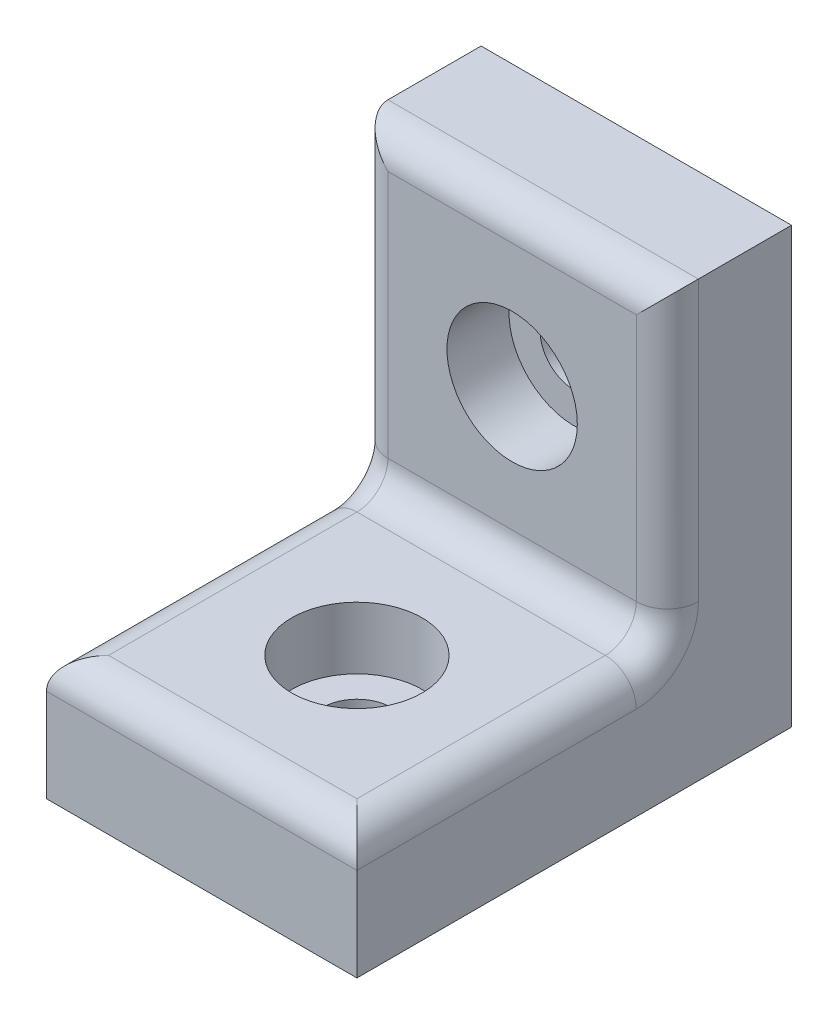
ISO-10303-21;
HEADER;
FILE_DESCRIPTION(('STEP AP214'),'2;1');
FILE_NAME('part.step','',(''),(''),'','','');
FILE_SCHEMA(('AUTOMOTIVE_DESIGN { 1 0 10303 214 1 1 1 1 }'));
ENDSEC;
DATA;
#1=APPLICATION_CONTEXT('core data for automotive mechanical design processes');
#2=APPLICATION_PROTOCOL_DEFINITION('international standard','automotive_design',2000,#1);
#3=PRODUCT_CONTEXT('',#1,'mechanical');
#4=PRODUCT('Part','Part','',(#3));
#5=PRODUCT_RELATED_PRODUCT_CATEGORY('part','',(#4));
#6=PRODUCT_DEFINITION_FORMATION('','',#4);
#7=PRODUCT_DEFINITION_CONTEXT('part definition',#1,'design');
#8=PRODUCT_DEFINITION('design','',#6,#7);
#9=PRODUCT_DEFINITION_SHAPE('','',#8);
#10=(LENGTH_UNIT() NAMED_UNIT(*) SI_UNIT(.MILLI.,.METRE.));
#11=(NAMED_UNIT(*) PLANE_ANGLE_UNIT() SI_UNIT($,.RADIAN.));
#12=(NAMED_UNIT(*) SI_UNIT($,.STERADIAN.) SOLID_ANGLE_UNIT());
#13=UNCERTAINTY_MEASURE_WITH_UNIT(LENGTH_MEASURE(1.E-05),#10,'distance_accuracy_value','');
#14=(GEOMETRIC_REPRESENTATION_CONTEXT(3) GLOBAL_UNCERTAINTY_ASSIGNED_CONTEXT((#13)) GLOBAL_UNIT_ASSIGNED_CONTEXT((#10,
#11,#12)) REPRESENTATION_CONTEXT('',''));
#15=CARTESIAN_POINT('',(0.,0.,0.));
#16=DIRECTION('',(0.,0.,1.));
#17=DIRECTION('',(1.,0.,0.));
#18=AXIS2_PLACEMENT_3D('',#15,#16,#17);
#19=CARTESIAN_POINT('',(0.,0.,9.));
#20=DIRECTION('',(0.,1.,0.));
#21=DIRECTION('',(0.,0.,1.));
#22=AXIS2_PLACEMENT_3D('',#19,#20,#21);
#23=CYLINDRICAL_SURFACE('',#22,1.1);
#24=CARTESIAN_POINT('',(0.,0.,9.));
#25=DIRECTION('',(0.,1.,0.));
#26=DIRECTION('',(0.,0.,1.));
#27=AXIS2_PLACEMENT_3D('',#24,#25,#26);
#28=CIRCLE('',#27,1.1);
#29=CARTESIAN_POINT('',(0.,0.,10.1));
#30=VERTEX_POINT('',#29);
#31=EDGE_CURVE('E201',#30,#30,#28,.T.);
#32=ORIENTED_EDGE('',*,*,#31,.F.);
#33=EDGE_LOOP('',(#32));
#34=FACE_BOUND('',#33,.T.);
#35=CARTESIAN_POINT('',(0.,2.,9.));
#36=DIRECTION('',(0.,1.,0.));
#37=DIRECTION('',(0.,0.,1.));
#38=AXIS2_PLACEMENT_3D('',#35,#36,#37);
#39=CIRCLE('',#38,1.1);
#40=CARTESIAN_POINT('',(0.,2.,10.1));
#41=VERTEX_POINT('',#40);
#42=EDGE_CURVE('E43',#41,#41,#39,.F.);
#43=ORIENTED_EDGE('',*,*,#42,.F.);
#44=EDGE_LOOP('',(#43));
#45=FACE_BOUND('',#44,.T.);
#46=ADVANCED_FACE('F39',(#34,#45),#23,.F.);
#47=CARTESIAN_POINT('',(0.,9.,0.));
#48=DIRECTION('',(0.,0.,1.));
#49=DIRECTION('',(1.,0.,0.));
#50=AXIS2_PLACEMENT_3D('',#47,#48,#49);
#51=CYLINDRICAL_SURFACE('',#50,1.1);
#52=CARTESIAN_POINT('',(0.,9.,0.));
#53=DIRECTION('',(0.,0.,1.));
#54=DIRECTION('',(1.,0.,0.));
#55=AXIS2_PLACEMENT_3D('',#52,#53,#54);
#56=CIRCLE('',#55,1.1);
#57=CARTESIAN_POINT('',(1.1,9.,0.));
#58=VERTEX_POINT('',#57);
#59=EDGE_CURVE('E136',#58,#58,#56,.T.);
#60=ORIENTED_EDGE('',*,*,#59,.F.);
#61=EDGE_LOOP('',(#60));
#62=FACE_BOUND('',#61,.T.);
#63=CARTESIAN_POINT('',(0.,9.,2.));
#64=DIRECTION('',(0.,0.,1.));
#65=DIRECTION('',(1.,0.,0.));
#66=AXIS2_PLACEMENT_3D('',#63,#64,#65);
#67=CIRCLE('',#66,1.1);
#68=CARTESIAN_POINT('',(1.1,9.,2.));
#69=VERTEX_POINT('',#68);
#70=EDGE_CURVE('E225',#69,#69,#67,.F.);
#71=ORIENTED_EDGE('',*,*,#70,.F.);
#72=EDGE_LOOP('',(#71));
#73=FACE_BOUND('',#72,.T.);
#74=ADVANCED_FACE('F248',(#62,#73),#51,.F.);
#75=CARTESIAN_POINT('',(-5.,14.,4.));
#76=DIRECTION('',(1.,0.,0.));
#77=DIRECTION('',(0.,1.,0.));
#78=AXIS2_PLACEMENT_3D('',#75,#76,#77);
#79=PLANE('',#78);
#80=CARTESIAN_POINT('',(-5.,5.,5.));
#81=DIRECTION('',(1.,0.,0.));
#82=DIRECTION('',(0.,1.,0.));
#83=AXIS2_PLACEMENT_3D('',#80,#81,#82);
#84=CIRCLE('',#83,2.);
#85=CARTESIAN_POINT('',(-5.,5.,3.));
#86=VERTEX_POINT('',#85);
#87=CARTESIAN_POINT('',(-5.,3.,5.));
#88=VERTEX_POINT('',#87);
#89=EDGE_CURVE('E185',#86,#88,#84,.F.);
#90=ORIENTED_EDGE('',*,*,#89,.F.);
#91=DIRECTION('',(0.,-1.,0.));
#92=VECTOR('',#91,1.);
#93=CARTESIAN_POINT('',(-5.,14.,3.));
#94=LINE('',#93,#92);
#95=CARTESIAN_POINT('',(-5.,14.,3.));
#96=VERTEX_POINT('',#95);
#97=EDGE_CURVE('E190',#86,#96,#94,.F.);
#98=ORIENTED_EDGE('',*,*,#97,.T.);
#99=DIRECTION('',(0.,0.,-1.));
#100=VECTOR('',#99,1.);
#101=CARTESIAN_POINT('',(-5.,14.,4.));
#102=LINE('',#101,#100);
#103=CARTESIAN_POINT('',(-5.,14.,0.));
#104=VERTEX_POINT('',#103);
#105=EDGE_CURVE('E164',#96,#104,#102,.T.);
#106=ORIENTED_EDGE('',*,*,#105,.T.);
#107=DIRECTION('',(0.,-1.,0.));
#108=VECTOR('',#107,1.);
#109=CARTESIAN_POINT('',(-5.,14.,0.));
#110=LINE('',#109,#108);
#111=CARTESIAN_POINT('',(-5.,0.,0.));
#112=VERTEX_POINT('',#111);
#113=EDGE_CURVE('E143',#104,#112,#110,.T.);
#114=ORIENTED_EDGE('',*,*,#113,.T.);
#115=DIRECTION('',(0.,0.,-1.));
#116=VECTOR('',#115,1.);
#117=CARTESIAN_POINT('',(-5.,0.,4.));
#118=LINE('',#117,#116);
#119=CARTESIAN_POINT('',(-5.,0.,14.));
#120=VERTEX_POINT('',#119);
#121=EDGE_CURVE('E140',#120,#112,#118,.T.);
#122=ORIENTED_EDGE('',*,*,#121,.F.);
#123=DIRECTION('',(0.,-1.,0.));
#124=VECTOR('',#123,1.);
#125=CARTESIAN_POINT('',(-5.,0.,14.));
#126=LINE('',#125,#124);
#127=CARTESIAN_POINT('',(-5.,3.,14.));
#128=VERTEX_POINT('',#127);
#129=EDGE_CURVE('E125',#128,#120,#126,.T.);
#130=ORIENTED_EDGE('',*,*,#129,.F.);
#131=DIRECTION('',(0.,0.,-1.));
#132=VECTOR('',#131,1.);
#133=CARTESIAN_POINT('',(-5.,3.,4.));
#134=LINE('',#133,#132);
#135=EDGE_CURVE('E188',#128,#88,#134,.T.);
#136=ORIENTED_EDGE('',*,*,#135,.T.);
#137=EDGE_LOOP('',(#90,#98,#106,#114,#122,#130,#136));
#138=FACE_BOUND('',#137,.T.);
#139=ADVANCED_FACE('F141',(#138),#79,.F.);
#140=CARTESIAN_POINT('',(-5.,0.,4.));
#141=DIRECTION('',(0.,1.,0.));
#142=DIRECTION('',(0.,0.,1.));
#143=AXIS2_PLACEMENT_3D('',#140,#141,#142);
#144=PLANE('',#143);
#145=ORIENTED_EDGE('',*,*,#31,.T.);
#146=EDGE_LOOP('',(#145));
#147=FACE_BOUND('',#146,.T.);
#148=DIRECTION('',(1.,0.,0.));
#149=VECTOR('',#148,1.);
#150=CARTESIAN_POINT('',(-5.,0.,0.));
#151=LINE('',#150,#149);
#152=CARTESIAN_POINT('',(5.,0.,0.));
#153=VERTEX_POINT('',#152);
#154=EDGE_CURVE('E156',#112,#153,#151,.T.);
#155=ORIENTED_EDGE('',*,*,#154,.T.);
#156=DIRECTION('',(0.,0.,-1.));
#157=VECTOR('',#156,1.);
#158=CARTESIAN_POINT('',(5.,0.,4.));
#159=LINE('',#158,#157);
#160=CARTESIAN_POINT('',(5.,0.,14.));
#161=VERTEX_POINT('',#160);
#162=EDGE_CURVE('E146',#161,#153,#159,.T.);
#163=ORIENTED_EDGE('',*,*,#162,.F.);
#164=DIRECTION('',(1.,0.,0.));
#165=VECTOR('',#164,1.);
#166=CARTESIAN_POINT('',(-5.,0.,14.));
#167=LINE('',#166,#165);
#168=EDGE_CURVE('E130',#120,#161,#167,.T.);
#169=ORIENTED_EDGE('',*,*,#168,.F.);
#170=ORIENTED_EDGE('',*,*,#121,.T.);
#171=EDGE_LOOP('',(#155,#163,#169,#170));
#172=FACE_BOUND('',#171,.T.);
#173=ADVANCED_FACE('F148',(#147,#172),#144,.F.);
#174=CARTESIAN_POINT('',(5.,14.,4.));
#175=DIRECTION('',(-1.,0.,0.));
#176=DIRECTION('',(0.,0.,1.));
#177=AXIS2_PLACEMENT_3D('',#174,#175,#176);
#178=PLANE('',#177);
#179=DIRECTION('',(0.,0.,-1.));
#180=VECTOR('',#179,1.);
#181=CARTESIAN_POINT('',(5.,14.,4.));
#182=LINE('',#181,#180);
#183=CARTESIAN_POINT('',(5.,14.,3.));
#184=VERTEX_POINT('',#183);
#185=CARTESIAN_POINT('',(5.,14.,0.));
#186=VERTEX_POINT('',#185);
#187=EDGE_CURVE('E166',#184,#186,#182,.T.);
#188=ORIENTED_EDGE('',*,*,#187,.F.);
#189=DIRECTION('',(0.,1.,0.));
#190=VECTOR('',#189,1.);
#191=CARTESIAN_POINT('',(5.,4.,3.));
#192=LINE('',#191,#190);
#193=CARTESIAN_POINT('',(5.,5.,3.));
#194=VERTEX_POINT('',#193);
#195=EDGE_CURVE('E182',#184,#194,#192,.F.);
#196=ORIENTED_EDGE('',*,*,#195,.T.);
#197=CARTESIAN_POINT('',(5.,5.,5.));
#198=DIRECTION('',(-1.,0.,0.));
#199=DIRECTION('',(0.,0.,1.));
#200=AXIS2_PLACEMENT_3D('',#197,#198,#199);
#201=CIRCLE('',#200,2.);
#202=CARTESIAN_POINT('',(5.,3.,5.));
#203=VERTEX_POINT('',#202);
#204=EDGE_CURVE('E179',#203,#194,#201,.F.);
#205=ORIENTED_EDGE('',*,*,#204,.F.);
#206=DIRECTION('',(0.,0.,-1.));
#207=VECTOR('',#206,1.);
#208=CARTESIAN_POINT('',(5.,3.,4.));
#209=LINE('',#208,#207);
#210=CARTESIAN_POINT('',(5.,3.,14.));
#211=VERTEX_POINT('',#210);
#212=EDGE_CURVE('E177',#203,#211,#209,.F.);
#213=ORIENTED_EDGE('',*,*,#212,.T.);
#214=DIRECTION('',(0.,1.,0.));
#215=VECTOR('',#214,1.);
#216=CARTESIAN_POINT('',(5.,0.,14.));
#217=LINE('',#216,#215);
#218=EDGE_CURVE('E150',#161,#211,#217,.T.);
#219=ORIENTED_EDGE('',*,*,#218,.F.);
#220=ORIENTED_EDGE('',*,*,#162,.T.);
#221=DIRECTION('',(0.,1.,0.));
#222=VECTOR('',#221,1.);
#223=CARTESIAN_POINT('',(5.,14.,0.));
#224=LINE('',#223,#222);
#225=EDGE_CURVE('E158',#153,#186,#224,.T.);
#226=ORIENTED_EDGE('',*,*,#225,.T.);
#227=EDGE_LOOP('',(#188,#196,#205,#213,#219,#220,#226));
#228=FACE_BOUND('',#227,.T.);
#229=ADVANCED_FACE('F276',(#228),#178,.F.);
#230=CARTESIAN_POINT('',(-5.,14.,4.));
#231=DIRECTION('',(0.,-1.,0.));
#232=DIRECTION('',(0.,0.,-1.));
#233=AXIS2_PLACEMENT_3D('',#230,#231,#232);
#234=PLANE('',#233);
#235=ORIENTED_EDGE('',*,*,#105,.F.);
#236=DIRECTION('',(-1.,0.,0.));
#237=VECTOR('',#236,1.);
#238=CARTESIAN_POINT('',(5.,14.,3.));
#239=LINE('',#238,#237);
#240=EDGE_CURVE('E12',#96,#184,#239,.F.);
#241=ORIENTED_EDGE('',*,*,#240,.T.);
#242=ORIENTED_EDGE('',*,*,#187,.T.);
#243=DIRECTION('',(-1.,0.,0.));
#244=VECTOR('',#243,1.);
#245=CARTESIAN_POINT('',(-5.,14.,0.));
#246=LINE('',#245,#244);
#247=EDGE_CURVE('E161',#186,#104,#246,.T.);
#248=ORIENTED_EDGE('',*,*,#247,.T.);
#249=EDGE_LOOP('',(#235,#241,#242,#248));
#250=FACE_BOUND('',#249,.T.);
#251=ADVANCED_FACE('F270',(#250),#234,.F.);
#252=CARTESIAN_POINT('',(0.,0.,4.));
#253=DIRECTION('',(0.,0.,1.));
#254=DIRECTION('',(1.,0.,0.));
#255=AXIS2_PLACEMENT_3D('',#252,#253,#254);
#256=PLANE('',#255);
#257=CARTESIAN_POINT('',(0.,9.,4.));
#258=DIRECTION('',(0.,0.,1.));
#259=DIRECTION('',(1.,0.,0.));
#260=AXIS2_PLACEMENT_3D('',#257,#258,#259);
#261=CIRCLE('',#260,2.1);
#262=CARTESIAN_POINT('',(2.1,9.,4.));
#263=VERTEX_POINT('',#262);
#264=EDGE_CURVE('E233',#263,#263,#261,.T.);
#265=ORIENTED_EDGE('',*,*,#264,.F.);
#266=EDGE_LOOP('',(#265));
#267=FACE_BOUND('',#266,.T.);
#268=DIRECTION('',(0.,1.,0.));
#269=VECTOR('',#268,1.);
#270=CARTESIAN_POINT('',(4.,14.,4.));
#271=LINE('',#270,#269);
#272=CARTESIAN_POINT('',(4.,5.,4.));
#273=VERTEX_POINT('',#272);
#274=CARTESIAN_POINT('',(4.,13.,4.));
#275=VERTEX_POINT('',#274);
#276=EDGE_CURVE('E172',#273,#275,#271,.T.);
#277=ORIENTED_EDGE('',*,*,#276,.T.);
#278=DIRECTION('',(-1.,0.,0.));
#279=VECTOR('',#278,1.);
#280=CARTESIAN_POINT('',(-5.,13.,4.));
#281=LINE('',#280,#279);
#282=CARTESIAN_POINT('',(-4.,13.,4.));
#283=VERTEX_POINT('',#282);
#284=EDGE_CURVE('E175',#275,#283,#281,.T.);
#285=ORIENTED_EDGE('',*,*,#284,.T.);
#286=DIRECTION('',(0.,-1.,0.));
#287=VECTOR('',#286,1.);
#288=CARTESIAN_POINT('',(-4.,4.,4.));
#289=LINE('',#288,#287);
#290=CARTESIAN_POINT('',(-4.,5.,4.));
#291=VERTEX_POINT('',#290);
#292=EDGE_CURVE('E170',#283,#291,#289,.T.);
#293=ORIENTED_EDGE('',*,*,#292,.T.);
#294=DIRECTION('',(-1.,0.,0.));
#295=VECTOR('',#294,1.);
#296=CARTESIAN_POINT('',(0.,5.,4.));
#297=LINE('',#296,#295);
#298=EDGE_CURVE('E145',#291,#273,#297,.F.);
#299=ORIENTED_EDGE('',*,*,#298,.T.);
#300=EDGE_LOOP('',(#277,#285,#293,#299));
#301=FACE_BOUND('',#300,.T.);
#302=ADVANCED_FACE('F267',(#267,#301),#256,.T.);
#303=CARTESIAN_POINT('',(0.,0.,0.));
#304=DIRECTION('',(0.,0.,1.));
#305=DIRECTION('',(1.,0.,0.));
#306=AXIS2_PLACEMENT_3D('',#303,#304,#305);
#307=PLANE('',#306);
#308=ORIENTED_EDGE('',*,*,#59,.T.);
#309=EDGE_LOOP('',(#308));
#310=FACE_BOUND('',#309,.T.);
#311=ORIENTED_EDGE('',*,*,#113,.F.);
#312=ORIENTED_EDGE('',*,*,#247,.F.);
#313=ORIENTED_EDGE('',*,*,#225,.F.);
#314=ORIENTED_EDGE('',*,*,#154,.F.);
#315=EDGE_LOOP('',(#311,#312,#313,#314));
#316=FACE_BOUND('',#315,.T.);
#317=ADVANCED_FACE('F245',(#310,#316),#307,.F.);
#318=CARTESIAN_POINT('',(-5.,4.,14.));
#319=DIRECTION('',(0.,-1.,0.));
#320=DIRECTION('',(0.,0.,-1.));
#321=AXIS2_PLACEMENT_3D('',#318,#319,#320);
#322=PLANE('',#321);
#323=CARTESIAN_POINT('',(0.,4.,9.));
#324=DIRECTION('',(0.,1.,0.));
#325=DIRECTION('',(0.,0.,1.));
#326=AXIS2_PLACEMENT_3D('',#323,#324,#325);
#327=CIRCLE('',#326,2.1);
#328=CARTESIAN_POINT('',(0.,4.,11.1));
#329=VERTEX_POINT('',#328);
#330=EDGE_CURVE('E240',#329,#329,#327,.T.);
#331=ORIENTED_EDGE('',*,*,#330,.F.);
#332=EDGE_LOOP('',(#331));
#333=FACE_BOUND('',#332,.T.);
#334=DIRECTION('',(0.,0.,-1.));
#335=VECTOR('',#334,1.);
#336=CARTESIAN_POINT('',(-4.,4.,14.));
#337=LINE('',#336,#335);
#338=CARTESIAN_POINT('',(-4.,4.,5.));
#339=VERTEX_POINT('',#338);
#340=CARTESIAN_POINT('',(-4.,4.,13.));
#341=VERTEX_POINT('',#340);
#342=EDGE_CURVE('E64',#339,#341,#337,.F.);
#343=ORIENTED_EDGE('',*,*,#342,.T.);
#344=DIRECTION('',(-1.,0.,0.));
#345=VECTOR('',#344,1.);
#346=CARTESIAN_POINT('',(-5.,4.,13.));
#347=LINE('',#346,#345);
#348=CARTESIAN_POINT('',(4.,4.,13.));
#349=VERTEX_POINT('',#348);
#350=EDGE_CURVE('E48',#341,#349,#347,.F.);
#351=ORIENTED_EDGE('',*,*,#350,.T.);
#352=DIRECTION('',(0.,0.,-1.));
#353=VECTOR('',#352,1.);
#354=CARTESIAN_POINT('',(4.,4.,14.));
#355=LINE('',#354,#353);
#356=CARTESIAN_POINT('',(4.,4.,5.));
#357=VERTEX_POINT('',#356);
#358=EDGE_CURVE('E56',#349,#357,#355,.T.);
#359=ORIENTED_EDGE('',*,*,#358,.T.);
#360=DIRECTION('',(-1.,0.,0.));
#361=VECTOR('',#360,1.);
#362=CARTESIAN_POINT('',(-5.,4.,5.));
#363=LINE('',#362,#361);
#364=EDGE_CURVE('E193',#357,#339,#363,.T.);
#365=ORIENTED_EDGE('',*,*,#364,.T.);
#366=EDGE_LOOP('',(#343,#351,#359,#365));
#367=FACE_BOUND('',#366,.T.);
#368=ADVANCED_FACE('F263',(#333,#367),#322,.F.);
#369=CARTESIAN_POINT('',(0.,0.,14.));
#370=DIRECTION('',(0.,0.,-1.));
#371=DIRECTION('',(-1.,0.,0.));
#372=AXIS2_PLACEMENT_3D('',#369,#370,#371);
#373=PLANE('',#372);
#374=ORIENTED_EDGE('',*,*,#218,.T.);
#375=DIRECTION('',(-1.,0.,0.));
#376=VECTOR('',#375,1.);
#377=CARTESIAN_POINT('',(0.,3.,14.));
#378=LINE('',#377,#376);
#379=EDGE_CURVE('E133',#211,#128,#378,.T.);
#380=ORIENTED_EDGE('',*,*,#379,.T.);
#381=ORIENTED_EDGE('',*,*,#129,.T.);
#382=ORIENTED_EDGE('',*,*,#168,.T.);
#383=EDGE_LOOP('',(#374,#380,#381,#382));
#384=FACE_BOUND('',#383,.T.);
#385=ADVANCED_FACE('F128',(#384),#373,.F.);
#386=CARTESIAN_POINT('',(-4.,3.,4.));
#387=DIRECTION('',(0.,0.,-1.));
#388=DIRECTION('',(-1.,0.,0.));
#389=AXIS2_PLACEMENT_3D('',#386,#387,#388);
#390=CYLINDRICAL_SURFACE('',#389,1.);
#391=CARTESIAN_POINT('',(-4.,3.,5.));
#392=DIRECTION('',(0.,0.,-1.));
#393=DIRECTION('',(-1.,0.,0.));
#394=AXIS2_PLACEMENT_3D('',#391,#392,#393);
#395=CIRCLE('',#394,1.);
#396=EDGE_CURVE('E220',#88,#339,#395,.T.);
#397=ORIENTED_EDGE('',*,*,#396,.F.);
#398=ORIENTED_EDGE('',*,*,#135,.F.);
#399=CARTESIAN_POINT('',(-4.,3.,13.));
#400=DIRECTION('',(-0.707106781186547,0.,-0.707106781186547));
#401=DIRECTION('',(0.707106781186547,0.,-0.707106781186547));
#402=AXIS2_PLACEMENT_3D('',#399,#400,#401);
#403=ELLIPSE('',#402,1.41421356237309,1.);
#404=EDGE_CURVE('E223',#341,#128,#403,.F.);
#405=ORIENTED_EDGE('',*,*,#404,.F.);
#406=ORIENTED_EDGE('',*,*,#342,.F.);
#407=EDGE_LOOP('',(#397,#398,#405,#406));
#408=FACE_BOUND('',#407,.T.);
#409=ADVANCED_FACE('F41',(#408),#390,.T.);
#410=CARTESIAN_POINT('',(0.,3.,13.));
#411=DIRECTION('',(-1.,0.,0.));
#412=DIRECTION('',(0.,0.,1.));
#413=AXIS2_PLACEMENT_3D('',#410,#411,#412);
#414=CYLINDRICAL_SURFACE('',#413,1.);
#415=ORIENTED_EDGE('',*,*,#404,.T.);
#416=ORIENTED_EDGE('',*,*,#379,.F.);
#417=CARTESIAN_POINT('',(4.,3.,13.));
#418=DIRECTION('',(0.707106781186547,0.,-0.707106781186547));
#419=DIRECTION('',(-0.707106781186547,0.,-0.707106781186547));
#420=AXIS2_PLACEMENT_3D('',#417,#418,#419);
#421=ELLIPSE('',#420,1.41421356237309,1.);
#422=EDGE_CURVE('E218',#349,#211,#421,.T.);
#423=ORIENTED_EDGE('',*,*,#422,.F.);
#424=ORIENTED_EDGE('',*,*,#350,.F.);
#425=EDGE_LOOP('',(#415,#416,#423,#424));
#426=FACE_BOUND('',#425,.T.);
#427=ADVANCED_FACE('F310',(#426),#414,.T.);
#428=CARTESIAN_POINT('',(-4.,5.,5.));
#429=DIRECTION('',(1.,0.,0.));
#430=DIRECTION('',(0.,1.,0.));
#431=AXIS2_PLACEMENT_3D('',#428,#429,#430);
#432=TOROIDAL_SURFACE('',#431,2.,1.);
#433=ORIENTED_EDGE('',*,*,#89,.T.);
#434=ORIENTED_EDGE('',*,*,#396,.T.);
#435=CARTESIAN_POINT('',(-4.,5.,5.));
#436=DIRECTION('',(1.,0.,0.));
#437=DIRECTION('',(0.,1.,0.));
#438=AXIS2_PLACEMENT_3D('',#435,#436,#437);
#439=CIRCLE('',#438,1.);
#440=EDGE_CURVE('E215',#291,#339,#439,.F.);
#441=ORIENTED_EDGE('',*,*,#440,.F.);
#442=CARTESIAN_POINT('',(-4.,5.,3.));
#443=DIRECTION('',(0.,-1.,0.));
#444=DIRECTION('',(0.,0.,-1.));
#445=AXIS2_PLACEMENT_3D('',#442,#443,#444);
#446=CIRCLE('',#445,1.);
#447=EDGE_CURVE('E212',#86,#291,#446,.F.);
#448=ORIENTED_EDGE('',*,*,#447,.F.);
#449=EDGE_LOOP('',(#433,#434,#441,#448));
#450=FACE_BOUND('',#449,.T.);
#451=ADVANCED_FACE('F308',(#450),#432,.T.);
#452=CARTESIAN_POINT('',(4.,3.,14.));
#453=DIRECTION('',(0.,0.,-1.));
#454=DIRECTION('',(-1.,0.,0.));
#455=AXIS2_PLACEMENT_3D('',#452,#453,#454);
#456=CYLINDRICAL_SURFACE('',#455,1.);
#457=ORIENTED_EDGE('',*,*,#422,.T.);
#458=ORIENTED_EDGE('',*,*,#212,.F.);
#459=CARTESIAN_POINT('',(4.,3.,5.));
#460=DIRECTION('',(0.,0.,-1.));
#461=DIRECTION('',(-1.,0.,0.));
#462=AXIS2_PLACEMENT_3D('',#459,#460,#461);
#463=CIRCLE('',#462,1.);
#464=EDGE_CURVE('E209',#357,#203,#463,.T.);
#465=ORIENTED_EDGE('',*,*,#464,.F.);
#466=ORIENTED_EDGE('',*,*,#358,.F.);
#467=EDGE_LOOP('',(#457,#458,#465,#466));
#468=FACE_BOUND('',#467,.T.);
#469=ADVANCED_FACE('F304',(#468),#456,.T.);
#470=CARTESIAN_POINT('',(-5.,5.,5.));
#471=DIRECTION('',(-1.,0.,0.));
#472=DIRECTION('',(0.,0.,1.));
#473=AXIS2_PLACEMENT_3D('',#470,#471,#472);
#474=CYLINDRICAL_SURFACE('',#473,1.);
#475=ORIENTED_EDGE('',*,*,#440,.T.);
#476=ORIENTED_EDGE('',*,*,#364,.F.);
#477=CARTESIAN_POINT('',(4.,5.,5.));
#478=DIRECTION('',(-1.,0.,0.));
#479=DIRECTION('',(0.,0.,1.));
#480=AXIS2_PLACEMENT_3D('',#477,#478,#479);
#481=CIRCLE('',#480,1.);
#482=EDGE_CURVE('E206',#273,#357,#481,.T.);
#483=ORIENTED_EDGE('',*,*,#482,.F.);
#484=ORIENTED_EDGE('',*,*,#298,.F.);
#485=EDGE_LOOP('',(#475,#476,#483,#484));
#486=FACE_BOUND('',#485,.T.);
#487=ADVANCED_FACE('F300',(#486),#474,.F.);
#488=CARTESIAN_POINT('',(-4.,0.,3.));
#489=DIRECTION('',(0.,1.,0.));
#490=DIRECTION('',(-1.,0.,0.));
#491=AXIS2_PLACEMENT_3D('',#488,#489,#490);
#492=CYLINDRICAL_SURFACE('',#491,1.);
#493=ORIENTED_EDGE('',*,*,#447,.T.);
#494=ORIENTED_EDGE('',*,*,#292,.F.);
#495=CARTESIAN_POINT('',(-4.,13.,3.));
#496=DIRECTION('',(0.707106781186547,0.707106781186548,0.));
#497=DIRECTION('',(0.707106781186547,-0.707106781186547,0.));
#498=AXIS2_PLACEMENT_3D('',#495,#496,#497);
#499=ELLIPSE('',#498,1.4142135623731,1.);
#500=EDGE_CURVE('E203',#96,#283,#499,.T.);
#501=ORIENTED_EDGE('',*,*,#500,.F.);
#502=ORIENTED_EDGE('',*,*,#97,.F.);
#503=EDGE_LOOP('',(#493,#494,#501,#502));
#504=FACE_BOUND('',#503,.T.);
#505=ADVANCED_FACE('F296',(#504),#492,.T.);
#506=CARTESIAN_POINT('',(4.,5.,5.));
#507=DIRECTION('',(-1.,0.,0.));
#508=DIRECTION('',(0.,0.,1.));
#509=AXIS2_PLACEMENT_3D('',#506,#507,#508);
#510=TOROIDAL_SURFACE('',#509,2.,1.);
#511=ORIENTED_EDGE('',*,*,#464,.T.);
#512=ORIENTED_EDGE('',*,*,#204,.T.);
#513=CARTESIAN_POINT('',(4.,5.,3.));
#514=DIRECTION('',(0.,-1.,0.));
#515=DIRECTION('',(0.,0.,-1.));
#516=AXIS2_PLACEMENT_3D('',#513,#514,#515);
#517=CIRCLE('',#516,1.);
#518=EDGE_CURVE('E200',#273,#194,#517,.F.);
#519=ORIENTED_EDGE('',*,*,#518,.F.);
#520=ORIENTED_EDGE('',*,*,#482,.T.);
#521=EDGE_LOOP('',(#511,#512,#519,#520));
#522=FACE_BOUND('',#521,.T.);
#523=ADVANCED_FACE('F292',(#522),#510,.T.);
#524=CARTESIAN_POINT('',(0.,13.,3.));
#525=DIRECTION('',(1.,0.,0.));
#526=DIRECTION('',(0.,0.,-1.));
#527=AXIS2_PLACEMENT_3D('',#524,#525,#526);
#528=CYLINDRICAL_SURFACE('',#527,1.);
#529=ORIENTED_EDGE('',*,*,#500,.T.);
#530=ORIENTED_EDGE('',*,*,#284,.F.);
#531=CARTESIAN_POINT('',(4.,13.,3.));
#532=DIRECTION('',(0.707106781186547,-0.707106781186547,0.));
#533=DIRECTION('',(0.707106781186547,0.707106781186547,0.));
#534=AXIS2_PLACEMENT_3D('',#531,#532,#533);
#535=ELLIPSE('',#534,1.41421356237309,1.);
#536=EDGE_CURVE('E198',#184,#275,#535,.T.);
#537=ORIENTED_EDGE('',*,*,#536,.F.);
#538=ORIENTED_EDGE('',*,*,#240,.F.);
#539=EDGE_LOOP('',(#529,#530,#537,#538));
#540=FACE_BOUND('',#539,.T.);
#541=ADVANCED_FACE('F288',(#540),#528,.T.);
#542=CARTESIAN_POINT('',(4.,0.,3.));
#543=DIRECTION('',(0.,-1.,0.));
#544=DIRECTION('',(0.,0.,-1.));
#545=AXIS2_PLACEMENT_3D('',#542,#543,#544);
#546=CYLINDRICAL_SURFACE('',#545,1.);
#547=ORIENTED_EDGE('',*,*,#518,.T.);
#548=ORIENTED_EDGE('',*,*,#195,.F.);
#549=ORIENTED_EDGE('',*,*,#536,.T.);
#550=ORIENTED_EDGE('',*,*,#276,.F.);
#551=EDGE_LOOP('',(#547,#548,#549,#550));
#552=FACE_BOUND('',#551,.T.);
#553=ADVANCED_FACE('F284',(#552),#546,.T.);
#554=CARTESIAN_POINT('',(0.,9.,2.));
#555=DIRECTION('',(0.,0.,1.));
#556=DIRECTION('',(1.,0.,0.));
#557=AXIS2_PLACEMENT_3D('',#554,#555,#556);
#558=PLANE('',#557);
#559=CARTESIAN_POINT('',(0.,9.,2.));
#560=DIRECTION('',(0.,0.,1.));
#561=DIRECTION('',(1.,0.,0.));
#562=AXIS2_PLACEMENT_3D('',#559,#560,#561);
#563=CIRCLE('',#562,2.1);
#564=CARTESIAN_POINT('',(2.1,9.,2.));
#565=VERTEX_POINT('',#564);
#566=EDGE_CURVE('E227',#565,#565,#563,.T.);
#567=ORIENTED_EDGE('',*,*,#566,.T.);
#568=EDGE_LOOP('',(#567));
#569=FACE_BOUND('',#568,.T.);
#570=ORIENTED_EDGE('',*,*,#70,.T.);
#571=EDGE_LOOP('',(#570));
#572=FACE_BOUND('',#571,.T.);
#573=ADVANCED_FACE('F287',(#569,#572),#558,.T.);
#574=CARTESIAN_POINT('',(0.,9.,2.));
#575=DIRECTION('',(0.,0.,1.));
#576=DIRECTION('',(1.,0.,0.));
#577=AXIS2_PLACEMENT_3D('',#574,#575,#576);
#578=CYLINDRICAL_SURFACE('',#577,2.1);
#579=ORIENTED_EDGE('',*,*,#566,.F.);
#580=EDGE_LOOP('',(#579));
#581=FACE_BOUND('',#580,.T.);
#582=ORIENTED_EDGE('',*,*,#264,.T.);
#583=EDGE_LOOP('',(#582));
#584=FACE_BOUND('',#583,.T.);
#585=ADVANCED_FACE('F454',(#581,#584),#578,.F.);
#586=CARTESIAN_POINT('',(0.,2.,9.));
#587=DIRECTION('',(0.,1.,0.));
#588=DIRECTION('',(0.,0.,1.));
#589=AXIS2_PLACEMENT_3D('',#586,#587,#588);
#590=PLANE('',#589);
#591=CARTESIAN_POINT('',(0.,2.,9.));
#592=DIRECTION('',(0.,1.,0.));
#593=DIRECTION('',(0.,0.,1.));
#594=AXIS2_PLACEMENT_3D('',#591,#592,#593);
#595=CIRCLE('',#594,2.1);
#596=CARTESIAN_POINT('',(0.,2.,11.1));
#597=VERTEX_POINT('',#596);
#598=EDGE_CURVE('E498',#597,#597,#595,.T.);
#599=ORIENTED_EDGE('',*,*,#598,.T.);
#600=EDGE_LOOP('',(#599));
#601=FACE_BOUND('',#600,.T.);
#602=ORIENTED_EDGE('',*,*,#42,.T.);
#603=EDGE_LOOP('',(#602));
#604=FACE_BOUND('',#603,.T.);
#605=ADVANCED_FACE('F462',(#601,#604),#590,.T.);
#606=CARTESIAN_POINT('',(0.,2.,9.));
#607=DIRECTION('',(0.,1.,0.));
#608=DIRECTION('',(0.,0.,1.));
#609=AXIS2_PLACEMENT_3D('',#606,#607,#608);
#610=CYLINDRICAL_SURFACE('',#609,2.1);
#611=ORIENTED_EDGE('',*,*,#598,.F.);
#612=EDGE_LOOP('',(#611));
#613=FACE_BOUND('',#612,.T.);
#614=ORIENTED_EDGE('',*,*,#330,.T.);
#615=EDGE_LOOP('',(#614));
#616=FACE_BOUND('',#615,.T.);
#617=ADVANCED_FACE('F473',(#613,#616),#610,.F.);
#618=CLOSED_SHELL('',(#46,#74,#139,#173,#229,#251,#302,#317,#368,#385,#409,#427,#451,#469,#487,
#505,#523,#541,#553,#573,#585,#605,#617));
#619=MANIFOLD_SOLID_BREP('B2',#618);
#620=ADVANCED_BREP_SHAPE_REPRESENTATION('',(#18,#619),#14);
#621=SHAPE_DEFINITION_REPRESENTATION(#9,#620);
ENDSEC;
END-ISO-10303-21;
